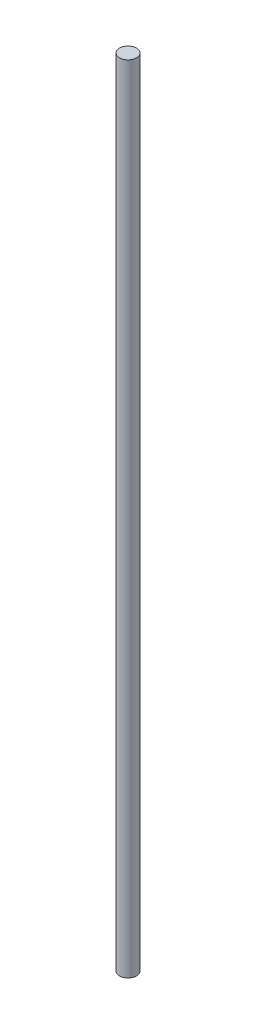
ISO-10303-21;
HEADER;
FILE_DESCRIPTION(('STEP AP214'),'2;1');
FILE_NAME('part.step','',(''),(''),'','','');
FILE_SCHEMA(('AUTOMOTIVE_DESIGN { 1 0 10303 214 1 1 1 1 }'));
ENDSEC;
DATA;
#1=APPLICATION_CONTEXT('core data for automotive mechanical design processes');
#2=APPLICATION_PROTOCOL_DEFINITION('international standard','automotive_design',2000,#1);
#3=PRODUCT_CONTEXT('',#1,'mechanical');
#4=PRODUCT('Part','Part','',(#3));
#5=PRODUCT_RELATED_PRODUCT_CATEGORY('part','',(#4));
#6=PRODUCT_DEFINITION_FORMATION('','',#4);
#7=PRODUCT_DEFINITION_CONTEXT('part definition',#1,'design');
#8=PRODUCT_DEFINITION('design','',#6,#7);
#9=PRODUCT_DEFINITION_SHAPE('','',#8);
#10=(LENGTH_UNIT() NAMED_UNIT(*) SI_UNIT(.MILLI.,.METRE.));
#11=(NAMED_UNIT(*) PLANE_ANGLE_UNIT() SI_UNIT($,.RADIAN.));
#12=(NAMED_UNIT(*) SI_UNIT($,.STERADIAN.) SOLID_ANGLE_UNIT());
#13=UNCERTAINTY_MEASURE_WITH_UNIT(LENGTH_MEASURE(1.E-05),#10,'distance_accuracy_value','');
#14=(GEOMETRIC_REPRESENTATION_CONTEXT(3) GLOBAL_UNCERTAINTY_ASSIGNED_CONTEXT((#13)) GLOBAL_UNIT_ASSIGNED_CONTEXT((#10,
#11,#12)) REPRESENTATION_CONTEXT('',''));
#15=CARTESIAN_POINT('',(0.,0.,0.));
#16=DIRECTION('',(0.,0.,1.));
#17=DIRECTION('',(1.,0.,0.));
#18=AXIS2_PLACEMENT_3D('',#15,#16,#17);
#19=CARTESIAN_POINT('',(1.66533453693773E-13,375.,1.11022302462516E-13));
#20=DIRECTION('',(0.,1.,0.));
#21=DIRECTION('',(-1.,0.,0.));
#22=AXIS2_PLACEMENT_3D('',#19,#20,#21);
#23=PLANE('',#22);
#24=CARTESIAN_POINT('',(1.66533453693773E-13,375.,1.11022302462516E-13));
#25=DIRECTION('',(0.,-1.,0.));
#26=DIRECTION('',(1.,0.,0.));
#27=AXIS2_PLACEMENT_3D('',#24,#25,#26);
#28=CIRCLE('',#27,4.);
#29=CARTESIAN_POINT('',(4.00000000000017,375.,1.11022302462516E-13));
#30=VERTEX_POINT('',#29);
#31=EDGE_CURVE('E17',#30,#30,#28,.T.);
#32=ORIENTED_EDGE('',*,*,#31,.F.);
#33=EDGE_LOOP('',(#32));
#34=FACE_BOUND('',#33,.T.);
#35=ADVANCED_FACE('F14',(#34),#23,.T.);
#36=CARTESIAN_POINT('',(0.,0.,0.));
#37=DIRECTION('',(0.,1.,0.));
#38=DIRECTION('',(-1.,0.,0.));
#39=AXIS2_PLACEMENT_3D('',#36,#37,#38);
#40=PLANE('',#39);
#41=CARTESIAN_POINT('',(1.66533453693773E-13,0.,1.11022302462515E-13));
#42=DIRECTION('',(0.,-1.,0.));
#43=DIRECTION('',(1.,0.,0.));
#44=AXIS2_PLACEMENT_3D('',#41,#42,#43);
#45=CIRCLE('',#44,4.);
#46=CARTESIAN_POINT('',(4.00000000000017,0.,1.11022302462515E-13));
#47=VERTEX_POINT('',#46);
#48=EDGE_CURVE('E10',#47,#47,#45,.F.);
#49=ORIENTED_EDGE('',*,*,#48,.F.);
#50=EDGE_LOOP('',(#49));
#51=FACE_BOUND('',#50,.T.);
#52=ADVANCED_FACE('F29',(#51),#40,.F.);
#53=CARTESIAN_POINT('',(1.66533453693773E-13,375.,1.11022302462516E-13));
#54=DIRECTION('',(0.,-1.,0.));
#55=DIRECTION('',(1.,0.,0.));
#56=AXIS2_PLACEMENT_3D('',#53,#54,#55);
#57=CYLINDRICAL_SURFACE('',#56,4.);
#58=ORIENTED_EDGE('',*,*,#48,.T.);
#59=EDGE_LOOP('',(#58));
#60=FACE_BOUND('',#59,.T.);
#61=ORIENTED_EDGE('',*,*,#31,.T.);
#62=EDGE_LOOP('',(#61));
#63=FACE_BOUND('',#62,.T.);
#64=ADVANCED_FACE('F26',(#60,#63),#57,.T.);
#65=CLOSED_SHELL('',(#35,#52,#64));
#66=MANIFOLD_SOLID_BREP('B1',#65);
#67=ADVANCED_BREP_SHAPE_REPRESENTATION('',(#18,#66),#14);
#68=SHAPE_DEFINITION_REPRESENTATION(#9,#67);
ENDSEC;
END-ISO-10303-21;
